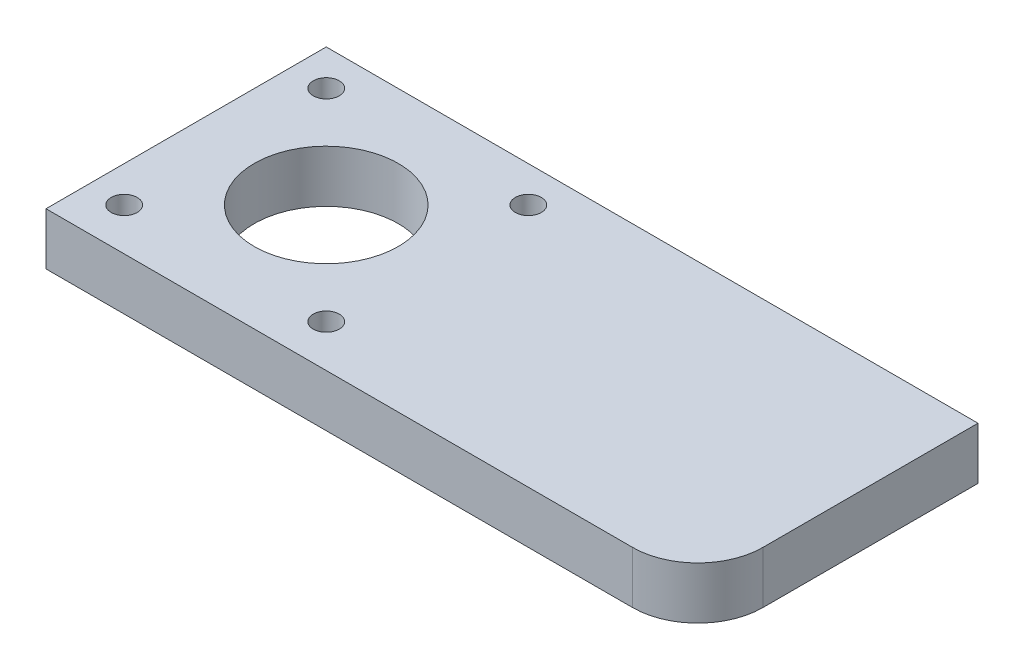
ISO-10303-21;
HEADER;
FILE_DESCRIPTION(('STEP AP214'),'2;1');
FILE_NAME('part.step','',(''),(''),'','','');
FILE_SCHEMA(('AUTOMOTIVE_DESIGN { 1 0 10303 214 1 1 1 1 }'));
ENDSEC;
DATA;
#1=APPLICATION_CONTEXT('core data for automotive mechanical design processes');
#2=APPLICATION_PROTOCOL_DEFINITION('international standard','automotive_design',2000,#1);
#3=PRODUCT_CONTEXT('',#1,'mechanical');
#4=PRODUCT('Part','Part','',(#3));
#5=PRODUCT_RELATED_PRODUCT_CATEGORY('part','',(#4));
#6=PRODUCT_DEFINITION_FORMATION('','',#4);
#7=PRODUCT_DEFINITION_CONTEXT('part definition',#1,'design');
#8=PRODUCT_DEFINITION('design','',#6,#7);
#9=PRODUCT_DEFINITION_SHAPE('','',#8);
#10=(LENGTH_UNIT() NAMED_UNIT(*) SI_UNIT(.MILLI.,.METRE.));
#11=(NAMED_UNIT(*) PLANE_ANGLE_UNIT() SI_UNIT($,.RADIAN.));
#12=(NAMED_UNIT(*) SI_UNIT($,.STERADIAN.) SOLID_ANGLE_UNIT());
#13=UNCERTAINTY_MEASURE_WITH_UNIT(LENGTH_MEASURE(1.E-05),#10,'distance_accuracy_value','');
#14=(GEOMETRIC_REPRESENTATION_CONTEXT(3) GLOBAL_UNCERTAINTY_ASSIGNED_CONTEXT((#13)) GLOBAL_UNIT_ASSIGNED_CONTEXT((#10,
#11,#12)) REPRESENTATION_CONTEXT('',''));
#15=CARTESIAN_POINT('',(0.,0.,0.));
#16=DIRECTION('',(0.,0.,1.));
#17=DIRECTION('',(1.,0.,0.));
#18=AXIS2_PLACEMENT_3D('',#15,#16,#17);
#19=CARTESIAN_POINT('',(40.,8.,11.5));
#20=DIRECTION('',(0.,1.,0.));
#21=DIRECTION('',(0.,0.,1.));
#22=AXIS2_PLACEMENT_3D('',#19,#20,#21);
#23=PLANE('',#22);
#24=CARTESIAN_POINT('',(-44.5000000000043,8.,14.9999999999913));
#25=DIRECTION('',(0.,1.,0.));
#26=DIRECTION('',(0.,0.,-1.));
#27=AXIS2_PLACEMENT_3D('',#24,#25,#26);
#28=CIRCLE('',#27,2.);
#29=CARTESIAN_POINT('',(-44.5000000000043,8.,12.9999999999913));
#30=VERTEX_POINT('',#29);
#31=EDGE_CURVE('E197',#30,#30,#28,.T.);
#32=ORIENTED_EDGE('',*,*,#31,.F.);
#33=EDGE_LOOP('',(#32));
#34=FACE_BOUND('',#33,.T.);
#35=CARTESIAN_POINT('',(-13.5000000000043,8.,14.9999999999913));
#36=DIRECTION('',(0.,1.,0.));
#37=DIRECTION('',(0.,0.,1.));
#38=AXIS2_PLACEMENT_3D('',#35,#36,#37);
#39=CIRCLE('',#38,2.);
#40=CARTESIAN_POINT('',(-13.5000000000043,8.,16.9999999999913));
#41=VERTEX_POINT('',#40);
#42=EDGE_CURVE('E213',#41,#41,#39,.T.);
#43=ORIENTED_EDGE('',*,*,#42,.F.);
#44=EDGE_LOOP('',(#43));
#45=FACE_BOUND('',#44,.T.);
#46=DIRECTION('',(0.,0.,-1.));
#47=VECTOR('',#46,1.);
#48=CARTESIAN_POINT('',(50.,8.,11.5));
#49=LINE('',#48,#47);
#50=CARTESIAN_POINT('',(50.,8.,11.5));
#51=VERTEX_POINT('',#50);
#52=CARTESIAN_POINT('',(50.,8.,-21.5));
#53=VERTEX_POINT('',#52);
#54=EDGE_CURVE('E133',#51,#53,#49,.T.);
#55=ORIENTED_EDGE('',*,*,#54,.T.);
#56=DIRECTION('',(-1.,0.,0.));
#57=VECTOR('',#56,1.);
#58=CARTESIAN_POINT('',(-50.,8.,-21.5));
#59=LINE('',#58,#57);
#60=CARTESIAN_POINT('',(-50.,8.,-21.5));
#61=VERTEX_POINT('',#60);
#62=EDGE_CURVE('E91',#53,#61,#59,.T.);
#63=ORIENTED_EDGE('',*,*,#62,.T.);
#64=DIRECTION('',(0.,0.,1.));
#65=VECTOR('',#64,1.);
#66=CARTESIAN_POINT('',(-50.,8.,21.5));
#67=LINE('',#66,#65);
#68=CARTESIAN_POINT('',(-50.,8.,21.5));
#69=VERTEX_POINT('',#68);
#70=EDGE_CURVE('E95',#61,#69,#67,.T.);
#71=ORIENTED_EDGE('',*,*,#70,.T.);
#72=DIRECTION('',(1.,0.,0.));
#73=VECTOR('',#72,1.);
#74=CARTESIAN_POINT('',(-50.,8.,21.5));
#75=LINE('',#74,#73);
#76=CARTESIAN_POINT('',(40.,8.,21.5));
#77=VERTEX_POINT('',#76);
#78=EDGE_CURVE('E99',#69,#77,#75,.T.);
#79=ORIENTED_EDGE('',*,*,#78,.T.);
#80=CARTESIAN_POINT('',(40.,8.,11.5));
#81=DIRECTION('',(0.,1.,0.));
#82=DIRECTION('',(0.,0.,1.));
#83=AXIS2_PLACEMENT_3D('',#80,#81,#82);
#84=CIRCLE('',#83,10.);
#85=EDGE_CURVE('E57',#77,#51,#84,.T.);
#86=ORIENTED_EDGE('',*,*,#85,.T.);
#87=EDGE_LOOP('',(#55,#63,#71,#79,#86));
#88=FACE_BOUND('',#87,.T.);
#89=CARTESIAN_POINT('',(-29.0000000000043,8.,-0.50000000000873));
#90=DIRECTION('',(0.,1.,0.));
#91=DIRECTION('',(0.,0.,1.));
#92=AXIS2_PLACEMENT_3D('',#89,#90,#91);
#93=CIRCLE('',#92,11.05);
#94=CARTESIAN_POINT('',(-29.0000000000043,8.,10.5499999999913));
#95=VERTEX_POINT('',#94);
#96=EDGE_CURVE('E124',#95,#95,#93,.T.);
#97=ORIENTED_EDGE('',*,*,#96,.F.);
#98=EDGE_LOOP('',(#97));
#99=FACE_BOUND('',#98,.T.);
#100=CARTESIAN_POINT('',(-13.5000000000043,8.,-16.0000000000087));
#101=DIRECTION('',(0.,1.,0.));
#102=DIRECTION('',(0.,0.,-1.));
#103=AXIS2_PLACEMENT_3D('',#100,#101,#102);
#104=CIRCLE('',#103,2.);
#105=CARTESIAN_POINT('',(-13.5000000000043,8.,-18.0000000000087));
#106=VERTEX_POINT('',#105);
#107=EDGE_CURVE('E205',#106,#106,#104,.T.);
#108=ORIENTED_EDGE('',*,*,#107,.F.);
#109=EDGE_LOOP('',(#108));
#110=FACE_BOUND('',#109,.T.);
#111=CARTESIAN_POINT('',(-44.5000000000043,8.,-16.0000000000087));
#112=DIRECTION('',(0.,1.,0.));
#113=DIRECTION('',(0.,0.,1.));
#114=AXIS2_PLACEMENT_3D('',#111,#112,#113);
#115=CIRCLE('',#114,2.);
#116=CARTESIAN_POINT('',(-44.5000000000043,8.,-14.0000000000087));
#117=VERTEX_POINT('',#116);
#118=EDGE_CURVE('E186',#117,#117,#115,.T.);
#119=ORIENTED_EDGE('',*,*,#118,.F.);
#120=EDGE_LOOP('',(#119));
#121=FACE_BOUND('',#120,.T.);
#122=ADVANCED_FACE('F39',(#34,#45,#88,#99,#110,#121),#23,.T.);
#123=CARTESIAN_POINT('',(40.,0.,11.5));
#124=DIRECTION('',(0.,1.,0.));
#125=DIRECTION('',(0.,0.,1.));
#126=AXIS2_PLACEMENT_3D('',#123,#124,#125);
#127=PLANE('',#126);
#128=DIRECTION('',(0.,0.,-1.));
#129=VECTOR('',#128,1.);
#130=CARTESIAN_POINT('',(50.,0.,11.5));
#131=LINE('',#130,#129);
#132=CARTESIAN_POINT('',(50.,0.,11.5));
#133=VERTEX_POINT('',#132);
#134=CARTESIAN_POINT('',(50.,0.,-21.5));
#135=VERTEX_POINT('',#134);
#136=EDGE_CURVE('E119',#133,#135,#131,.T.);
#137=ORIENTED_EDGE('',*,*,#136,.F.);
#138=CARTESIAN_POINT('',(40.,0.,11.5));
#139=DIRECTION('',(0.,1.,0.));
#140=DIRECTION('',(0.,0.,1.));
#141=AXIS2_PLACEMENT_3D('',#138,#139,#140);
#142=CIRCLE('',#141,10.);
#143=CARTESIAN_POINT('',(40.,0.,21.5));
#144=VERTEX_POINT('',#143);
#145=EDGE_CURVE('E83',#144,#133,#142,.T.);
#146=ORIENTED_EDGE('',*,*,#145,.F.);
#147=DIRECTION('',(1.,0.,0.));
#148=VECTOR('',#147,1.);
#149=CARTESIAN_POINT('',(-50.,0.,21.5));
#150=LINE('',#149,#148);
#151=CARTESIAN_POINT('',(-50.,0.,21.5));
#152=VERTEX_POINT('',#151);
#153=EDGE_CURVE('E77',#152,#144,#150,.T.);
#154=ORIENTED_EDGE('',*,*,#153,.F.);
#155=DIRECTION('',(0.,0.,1.));
#156=VECTOR('',#155,1.);
#157=CARTESIAN_POINT('',(-50.,0.,21.5));
#158=LINE('',#157,#156);
#159=CARTESIAN_POINT('',(-50.,0.,-21.5));
#160=VERTEX_POINT('',#159);
#161=EDGE_CURVE('E107',#160,#152,#158,.T.);
#162=ORIENTED_EDGE('',*,*,#161,.F.);
#163=DIRECTION('',(-1.,0.,0.));
#164=VECTOR('',#163,1.);
#165=CARTESIAN_POINT('',(-50.,0.,-21.5));
#166=LINE('',#165,#164);
#167=EDGE_CURVE('E123',#135,#160,#166,.T.);
#168=ORIENTED_EDGE('',*,*,#167,.F.);
#169=EDGE_LOOP('',(#137,#146,#154,#162,#168));
#170=FACE_BOUND('',#169,.T.);
#171=CARTESIAN_POINT('',(-29.0000000000043,0.,-0.50000000000873));
#172=DIRECTION('',(0.,1.,0.));
#173=DIRECTION('',(0.,0.,1.));
#174=AXIS2_PLACEMENT_3D('',#171,#172,#173);
#175=CIRCLE('',#174,11.05);
#176=CARTESIAN_POINT('',(-29.0000000000043,0.,10.5499999999913));
#177=VERTEX_POINT('',#176);
#178=EDGE_CURVE('E217',#177,#177,#175,.T.);
#179=ORIENTED_EDGE('',*,*,#178,.T.);
#180=EDGE_LOOP('',(#179));
#181=FACE_BOUND('',#180,.T.);
#182=CARTESIAN_POINT('',(-13.5000000000043,0.,14.9999999999913));
#183=DIRECTION('',(0.,1.,0.));
#184=DIRECTION('',(0.,0.,1.));
#185=AXIS2_PLACEMENT_3D('',#182,#183,#184);
#186=CIRCLE('',#185,2.);
#187=CARTESIAN_POINT('',(-13.5000000000043,0.,16.9999999999913));
#188=VERTEX_POINT('',#187);
#189=EDGE_CURVE('E209',#188,#188,#186,.T.);
#190=ORIENTED_EDGE('',*,*,#189,.T.);
#191=EDGE_LOOP('',(#190));
#192=FACE_BOUND('',#191,.T.);
#193=CARTESIAN_POINT('',(-13.5000000000043,0.,-16.0000000000087));
#194=DIRECTION('',(0.,1.,0.));
#195=DIRECTION('',(0.,0.,-1.));
#196=AXIS2_PLACEMENT_3D('',#193,#194,#195);
#197=CIRCLE('',#196,2.);
#198=CARTESIAN_POINT('',(-13.5000000000043,0.,-18.0000000000087));
#199=VERTEX_POINT('',#198);
#200=EDGE_CURVE('E201',#199,#199,#197,.T.);
#201=ORIENTED_EDGE('',*,*,#200,.T.);
#202=EDGE_LOOP('',(#201));
#203=FACE_BOUND('',#202,.T.);
#204=CARTESIAN_POINT('',(-44.5000000000043,0.,14.9999999999913));
#205=DIRECTION('',(0.,1.,0.));
#206=DIRECTION('',(0.,0.,-1.));
#207=AXIS2_PLACEMENT_3D('',#204,#205,#206);
#208=CIRCLE('',#207,2.);
#209=CARTESIAN_POINT('',(-44.5000000000043,0.,12.9999999999913));
#210=VERTEX_POINT('',#209);
#211=EDGE_CURVE('E194',#210,#210,#208,.T.);
#212=ORIENTED_EDGE('',*,*,#211,.T.);
#213=EDGE_LOOP('',(#212));
#214=FACE_BOUND('',#213,.T.);
#215=CARTESIAN_POINT('',(-44.5000000000043,0.,-16.0000000000087));
#216=DIRECTION('',(0.,1.,0.));
#217=DIRECTION('',(0.,0.,1.));
#218=AXIS2_PLACEMENT_3D('',#215,#216,#217);
#219=CIRCLE('',#218,2.);
#220=CARTESIAN_POINT('',(-44.5000000000043,0.,-14.0000000000087));
#221=VERTEX_POINT('',#220);
#222=EDGE_CURVE('E189',#221,#221,#219,.T.);
#223=ORIENTED_EDGE('',*,*,#222,.T.);
#224=EDGE_LOOP('',(#223));
#225=FACE_BOUND('',#224,.T.);
#226=ADVANCED_FACE('F140',(#170,#181,#192,#203,#214,#225),#127,.F.);
#227=CARTESIAN_POINT('',(50.,8.,11.5));
#228=DIRECTION('',(-1.,0.,0.));
#229=DIRECTION('',(0.,0.,1.));
#230=AXIS2_PLACEMENT_3D('',#227,#228,#229);
#231=PLANE('',#230);
#232=ORIENTED_EDGE('',*,*,#136,.T.);
#233=DIRECTION('',(0.,-1.,0.));
#234=VECTOR('',#233,1.);
#235=CARTESIAN_POINT('',(50.,8.,-21.5));
#236=LINE('',#235,#234);
#237=EDGE_CURVE('E11',#53,#135,#236,.T.);
#238=ORIENTED_EDGE('',*,*,#237,.F.);
#239=ORIENTED_EDGE('',*,*,#54,.F.);
#240=DIRECTION('',(0.,-1.,0.));
#241=VECTOR('',#240,1.);
#242=CARTESIAN_POINT('',(50.,8.,11.5));
#243=LINE('',#242,#241);
#244=EDGE_CURVE('E115',#51,#133,#243,.T.);
#245=ORIENTED_EDGE('',*,*,#244,.T.);
#246=EDGE_LOOP('',(#232,#238,#239,#245));
#247=FACE_BOUND('',#246,.T.);
#248=ADVANCED_FACE('F41',(#247),#231,.F.);
#249=CARTESIAN_POINT('',(-50.,8.,-21.5));
#250=DIRECTION('',(0.,0.,1.));
#251=DIRECTION('',(1.,0.,0.));
#252=AXIS2_PLACEMENT_3D('',#249,#250,#251);
#253=PLANE('',#252);
#254=ORIENTED_EDGE('',*,*,#167,.T.);
#255=DIRECTION('',(0.,-1.,0.));
#256=VECTOR('',#255,1.);
#257=CARTESIAN_POINT('',(-50.,8.,-21.5));
#258=LINE('',#257,#256);
#259=EDGE_CURVE('E49',#61,#160,#258,.T.);
#260=ORIENTED_EDGE('',*,*,#259,.F.);
#261=ORIENTED_EDGE('',*,*,#62,.F.);
#262=ORIENTED_EDGE('',*,*,#237,.T.);
#263=EDGE_LOOP('',(#254,#260,#261,#262));
#264=FACE_BOUND('',#263,.T.);
#265=ADVANCED_FACE('F280',(#264),#253,.F.);
#266=CARTESIAN_POINT('',(-50.,8.,21.5));
#267=DIRECTION('',(1.,0.,0.));
#268=DIRECTION('',(0.,0.,-1.));
#269=AXIS2_PLACEMENT_3D('',#266,#267,#268);
#270=PLANE('',#269);
#271=ORIENTED_EDGE('',*,*,#161,.T.);
#272=DIRECTION('',(0.,-1.,0.));
#273=VECTOR('',#272,1.);
#274=CARTESIAN_POINT('',(-50.,8.,21.5));
#275=LINE('',#274,#273);
#276=EDGE_CURVE('E104',#69,#152,#275,.T.);
#277=ORIENTED_EDGE('',*,*,#276,.F.);
#278=ORIENTED_EDGE('',*,*,#70,.F.);
#279=ORIENTED_EDGE('',*,*,#259,.T.);
#280=EDGE_LOOP('',(#271,#277,#278,#279));
#281=FACE_BOUND('',#280,.T.);
#282=ADVANCED_FACE('F105',(#281),#270,.F.);
#283=CARTESIAN_POINT('',(-50.,8.,21.5));
#284=DIRECTION('',(0.,0.,-1.));
#285=DIRECTION('',(-1.,0.,0.));
#286=AXIS2_PLACEMENT_3D('',#283,#284,#285);
#287=PLANE('',#286);
#288=ORIENTED_EDGE('',*,*,#153,.T.);
#289=DIRECTION('',(0.,-1.,0.));
#290=VECTOR('',#289,1.);
#291=CARTESIAN_POINT('',(40.,8.,21.5));
#292=LINE('',#291,#290);
#293=EDGE_CURVE('E109',#77,#144,#292,.T.);
#294=ORIENTED_EDGE('',*,*,#293,.F.);
#295=ORIENTED_EDGE('',*,*,#78,.F.);
#296=ORIENTED_EDGE('',*,*,#276,.T.);
#297=EDGE_LOOP('',(#288,#294,#295,#296));
#298=FACE_BOUND('',#297,.T.);
#299=ADVANCED_FACE('F111',(#298),#287,.F.);
#300=CARTESIAN_POINT('',(40.,8.,11.5));
#301=DIRECTION('',(0.,-1.,0.));
#302=DIRECTION('',(0.,0.,-1.));
#303=AXIS2_PLACEMENT_3D('',#300,#301,#302);
#304=CYLINDRICAL_SURFACE('',#303,10.);
#305=ORIENTED_EDGE('',*,*,#145,.T.);
#306=ORIENTED_EDGE('',*,*,#244,.F.);
#307=ORIENTED_EDGE('',*,*,#85,.F.);
#308=ORIENTED_EDGE('',*,*,#293,.T.);
#309=EDGE_LOOP('',(#305,#306,#307,#308));
#310=FACE_BOUND('',#309,.T.);
#311=ADVANCED_FACE('F145',(#310),#304,.T.);
#312=CARTESIAN_POINT('',(-29.0000000000043,8.,-0.50000000000873));
#313=DIRECTION('',(0.,-1.,0.));
#314=DIRECTION('',(0.,0.,-1.));
#315=AXIS2_PLACEMENT_3D('',#312,#313,#314);
#316=CYLINDRICAL_SURFACE('',#315,11.05);
#317=ORIENTED_EDGE('',*,*,#96,.T.);
#318=EDGE_LOOP('',(#317));
#319=FACE_BOUND('',#318,.T.);
#320=ORIENTED_EDGE('',*,*,#178,.F.);
#321=EDGE_LOOP('',(#320));
#322=FACE_BOUND('',#321,.T.);
#323=ADVANCED_FACE('F147',(#319,#322),#316,.F.);
#324=CARTESIAN_POINT('',(-13.5000000000043,8.,14.9999999999913));
#325=DIRECTION('',(0.,-1.,0.));
#326=DIRECTION('',(0.,0.,-1.));
#327=AXIS2_PLACEMENT_3D('',#324,#325,#326);
#328=CYLINDRICAL_SURFACE('',#327,2.);
#329=ORIENTED_EDGE('',*,*,#42,.T.);
#330=EDGE_LOOP('',(#329));
#331=FACE_BOUND('',#330,.T.);
#332=ORIENTED_EDGE('',*,*,#189,.F.);
#333=EDGE_LOOP('',(#332));
#334=FACE_BOUND('',#333,.T.);
#335=ADVANCED_FACE('F153',(#331,#334),#328,.F.);
#336=CARTESIAN_POINT('',(-13.5000000000043,8.,-16.0000000000087));
#337=DIRECTION('',(0.,-1.,0.));
#338=DIRECTION('',(0.,0.,-1.));
#339=AXIS2_PLACEMENT_3D('',#336,#337,#338);
#340=CYLINDRICAL_SURFACE('',#339,2.);
#341=ORIENTED_EDGE('',*,*,#107,.T.);
#342=EDGE_LOOP('',(#341));
#343=FACE_BOUND('',#342,.T.);
#344=ORIENTED_EDGE('',*,*,#200,.F.);
#345=EDGE_LOOP('',(#344));
#346=FACE_BOUND('',#345,.T.);
#347=ADVANCED_FACE('F169',(#343,#346),#340,.F.);
#348=CARTESIAN_POINT('',(-44.5000000000043,8.,14.9999999999913));
#349=DIRECTION('',(0.,-1.,0.));
#350=DIRECTION('',(0.,0.,-1.));
#351=AXIS2_PLACEMENT_3D('',#348,#349,#350);
#352=CYLINDRICAL_SURFACE('',#351,2.);
#353=ORIENTED_EDGE('',*,*,#31,.T.);
#354=EDGE_LOOP('',(#353));
#355=FACE_BOUND('',#354,.T.);
#356=ORIENTED_EDGE('',*,*,#211,.F.);
#357=EDGE_LOOP('',(#356));
#358=FACE_BOUND('',#357,.T.);
#359=ADVANCED_FACE('F173',(#355,#358),#352,.F.);
#360=CARTESIAN_POINT('',(-44.5000000000043,8.,-16.0000000000087));
#361=DIRECTION('',(0.,-1.,0.));
#362=DIRECTION('',(0.,0.,-1.));
#363=AXIS2_PLACEMENT_3D('',#360,#361,#362);
#364=CYLINDRICAL_SURFACE('',#363,2.);
#365=ORIENTED_EDGE('',*,*,#118,.T.);
#366=EDGE_LOOP('',(#365));
#367=FACE_BOUND('',#366,.T.);
#368=ORIENTED_EDGE('',*,*,#222,.F.);
#369=EDGE_LOOP('',(#368));
#370=FACE_BOUND('',#369,.T.);
#371=ADVANCED_FACE('F177',(#367,#370),#364,.F.);
#372=CLOSED_SHELL('',(#122,#226,#248,#265,#282,#299,#311,#323,#335,#347,#359,#371));
#373=MANIFOLD_SOLID_BREP('B2',#372);
#374=ADVANCED_BREP_SHAPE_REPRESENTATION('',(#18,#373),#14);
#375=SHAPE_DEFINITION_REPRESENTATION(#9,#374);
ENDSEC;
END-ISO-10303-21;
